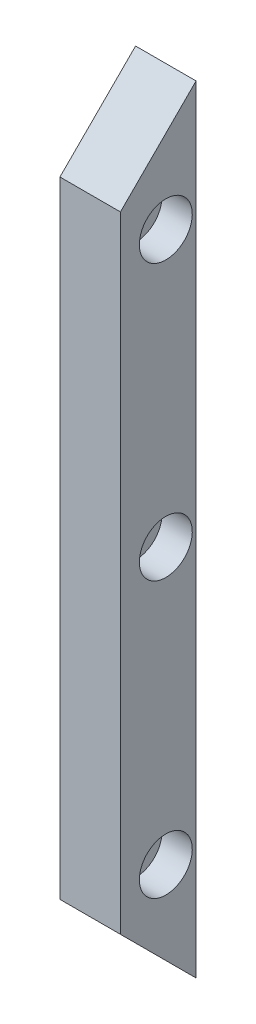
ISO-10303-21;
HEADER;
FILE_DESCRIPTION(('STEP AP214'),'2;1');
FILE_NAME('part.step','',(''),(''),'','','');
FILE_SCHEMA(('AUTOMOTIVE_DESIGN { 1 0 10303 214 1 1 1 1 }'));
ENDSEC;
DATA;
#1=APPLICATION_CONTEXT('core data for automotive mechanical design processes');
#2=APPLICATION_PROTOCOL_DEFINITION('international standard','automotive_design',2000,#1);
#3=PRODUCT_CONTEXT('',#1,'mechanical');
#4=PRODUCT('Part','Part','',(#3));
#5=PRODUCT_RELATED_PRODUCT_CATEGORY('part','',(#4));
#6=PRODUCT_DEFINITION_FORMATION('','',#4);
#7=PRODUCT_DEFINITION_CONTEXT('part definition',#1,'design');
#8=PRODUCT_DEFINITION('design','',#6,#7);
#9=PRODUCT_DEFINITION_SHAPE('','',#8);
#10=(LENGTH_UNIT() NAMED_UNIT(*) SI_UNIT(.MILLI.,.METRE.));
#11=(NAMED_UNIT(*) PLANE_ANGLE_UNIT() SI_UNIT($,.RADIAN.));
#12=(NAMED_UNIT(*) SI_UNIT($,.STERADIAN.) SOLID_ANGLE_UNIT());
#13=UNCERTAINTY_MEASURE_WITH_UNIT(LENGTH_MEASURE(1.E-05),#10,'distance_accuracy_value','');
#14=(GEOMETRIC_REPRESENTATION_CONTEXT(3) GLOBAL_UNCERTAINTY_ASSIGNED_CONTEXT((#13)) GLOBAL_UNIT_ASSIGNED_CONTEXT((#10,
#11,#12)) REPRESENTATION_CONTEXT('',''));
#15=CARTESIAN_POINT('',(0.,0.,0.));
#16=DIRECTION('',(0.,0.,1.));
#17=DIRECTION('',(1.,0.,0.));
#18=AXIS2_PLACEMENT_3D('',#15,#16,#17);
#19=CARTESIAN_POINT('',(7.99999999999994,-61.9999999999953,8.));
#20=DIRECTION('',(0.,0.,-1.));
#21=DIRECTION('',(1.,0.,0.));
#22=AXIS2_PLACEMENT_3D('',#19,#20,#21);
#23=PLANE('',#22);
#24=DIRECTION('',(0.,1.,0.));
#25=VECTOR('',#24,1.);
#26=CARTESIAN_POINT('',(0.,-61.9999999999952,8.));
#27=LINE('',#26,#25);
#28=CARTESIAN_POINT('',(0.,-61.9999999999952,8.));
#29=VERTEX_POINT('',#28);
#30=CARTESIAN_POINT('',(0.,40.7303555077418,8.));
#31=VERTEX_POINT('',#30);
#32=EDGE_CURVE('E101',#29,#31,#27,.T.);
#33=ORIENTED_EDGE('',*,*,#32,.T.);
#34=DIRECTION('',(-1.,0.,0.));
#35=VECTOR('',#34,1.);
#36=CARTESIAN_POINT('',(8.00000000000004,40.7303555077418,8.));
#37=LINE('',#36,#35);
#38=CARTESIAN_POINT('',(8.00000000000004,40.7303555077418,8.));
#39=VERTEX_POINT('',#38);
#40=EDGE_CURVE('E94',#39,#31,#37,.T.);
#41=ORIENTED_EDGE('',*,*,#40,.F.);
#42=DIRECTION('',(0.,1.,0.));
#43=VECTOR('',#42,1.);
#44=CARTESIAN_POINT('',(7.99999999999994,-61.9999999999953,8.));
#45=LINE('',#44,#43);
#46=CARTESIAN_POINT('',(7.99999999999994,-61.9999999999953,8.));
#47=VERTEX_POINT('',#46);
#48=EDGE_CURVE('E88',#47,#39,#45,.T.);
#49=ORIENTED_EDGE('',*,*,#48,.F.);
#50=DIRECTION('',(-1.,0.,0.));
#51=VECTOR('',#50,1.);
#52=CARTESIAN_POINT('',(7.99999999999994,-61.9999999999953,8.));
#53=LINE('',#52,#51);
#54=EDGE_CURVE('E11',#47,#29,#53,.T.);
#55=ORIENTED_EDGE('',*,*,#54,.T.);
#56=EDGE_LOOP('',(#33,#41,#49,#55));
#57=FACE_BOUND('',#56,.T.);
#58=ADVANCED_FACE('F35',(#57),#23,.T.);
#59=CARTESIAN_POINT('',(7.99999999999995,-51.9999999999952,18.));
#60=DIRECTION('',(0.,-0.707106781186545,0.70710678118655));
#61=DIRECTION('',(0.,-0.70710678118655,-0.707106781186545));
#62=AXIS2_PLACEMENT_3D('',#59,#60,#61);
#63=PLANE('',#62);
#64=DIRECTION('',(0.,-0.70710678118655,-0.707106781186545));
#65=VECTOR('',#64,1.);
#66=CARTESIAN_POINT('',(0.,-51.9999999999952,18.));
#67=LINE('',#66,#65);
#68=CARTESIAN_POINT('',(0.,-51.9999999999952,18.));
#69=VERTEX_POINT('',#68);
#70=EDGE_CURVE('E76',#69,#29,#67,.T.);
#71=ORIENTED_EDGE('',*,*,#70,.T.);
#72=ORIENTED_EDGE('',*,*,#54,.F.);
#73=DIRECTION('',(0.,-0.70710678118655,-0.707106781186545));
#74=VECTOR('',#73,1.);
#75=CARTESIAN_POINT('',(7.99999999999995,-51.9999999999952,18.));
#76=LINE('',#75,#74);
#77=CARTESIAN_POINT('',(7.99999999999995,-51.9999999999952,18.));
#78=VERTEX_POINT('',#77);
#79=EDGE_CURVE('E53',#78,#47,#76,.T.);
#80=ORIENTED_EDGE('',*,*,#79,.F.);
#81=DIRECTION('',(-1.,0.,0.));
#82=VECTOR('',#81,1.);
#83=CARTESIAN_POINT('',(7.99999999999995,-51.9999999999952,18.));
#84=LINE('',#83,#82);
#85=EDGE_CURVE('E44',#78,#69,#84,.T.);
#86=ORIENTED_EDGE('',*,*,#85,.T.);
#87=EDGE_LOOP('',(#71,#72,#80,#86));
#88=FACE_BOUND('',#87,.T.);
#89=ADVANCED_FACE('F167',(#88),#63,.T.);
#90=CARTESIAN_POINT('',(8.00000000000003,30.7303555077419,18.));
#91=DIRECTION('',(0.,0.,1.));
#92=DIRECTION('',(0.,-1.,0.));
#93=AXIS2_PLACEMENT_3D('',#90,#91,#92);
#94=PLANE('',#93);
#95=DIRECTION('',(0.,-1.,0.));
#96=VECTOR('',#95,1.);
#97=CARTESIAN_POINT('',(0.,30.7303555077419,18.));
#98=LINE('',#97,#96);
#99=CARTESIAN_POINT('',(0.,30.7303555077419,18.));
#100=VERTEX_POINT('',#99);
#101=EDGE_CURVE('E70',#100,#69,#98,.T.);
#102=ORIENTED_EDGE('',*,*,#101,.T.);
#103=ORIENTED_EDGE('',*,*,#85,.F.);
#104=DIRECTION('',(0.,-1.,0.));
#105=VECTOR('',#104,1.);
#106=CARTESIAN_POINT('',(8.00000000000003,30.7303555077419,18.));
#107=LINE('',#106,#105);
#108=CARTESIAN_POINT('',(8.00000000000003,30.7303555077419,18.));
#109=VERTEX_POINT('',#108);
#110=EDGE_CURVE('E86',#109,#78,#107,.T.);
#111=ORIENTED_EDGE('',*,*,#110,.F.);
#112=DIRECTION('',(-1.,0.,0.));
#113=VECTOR('',#112,1.);
#114=CARTESIAN_POINT('',(8.00000000000003,30.7303555077419,18.));
#115=LINE('',#114,#113);
#116=EDGE_CURVE('E91',#109,#100,#115,.T.);
#117=ORIENTED_EDGE('',*,*,#116,.T.);
#118=EDGE_LOOP('',(#102,#103,#111,#117));
#119=FACE_BOUND('',#118,.T.);
#120=ADVANCED_FACE('F96',(#119),#94,.T.);
#121=CARTESIAN_POINT('',(8.00000000000004,40.7303555077418,8.));
#122=DIRECTION('',(0.,0.707106781186554,0.707106781186541));
#123=DIRECTION('',(0.,-0.707106781186541,0.707106781186554));
#124=AXIS2_PLACEMENT_3D('',#121,#122,#123);
#125=PLANE('',#124);
#126=DIRECTION('',(0.,-0.707106781186541,0.707106781186554));
#127=VECTOR('',#126,1.);
#128=CARTESIAN_POINT('',(0.,40.7303555077418,8.));
#129=LINE('',#128,#127);
#130=EDGE_CURVE('E93',#31,#100,#129,.T.);
#131=ORIENTED_EDGE('',*,*,#130,.T.);
#132=ORIENTED_EDGE('',*,*,#116,.F.);
#133=DIRECTION('',(0.,-0.707106781186541,0.707106781186554));
#134=VECTOR('',#133,1.);
#135=CARTESIAN_POINT('',(8.00000000000004,40.7303555077418,8.));
#136=LINE('',#135,#134);
#137=EDGE_CURVE('E83',#39,#109,#136,.T.);
#138=ORIENTED_EDGE('',*,*,#137,.F.);
#139=ORIENTED_EDGE('',*,*,#40,.T.);
#140=EDGE_LOOP('',(#131,#132,#138,#139));
#141=FACE_BOUND('',#140,.T.);
#142=ADVANCED_FACE('F92',(#141),#125,.T.);
#143=CARTESIAN_POINT('',(8.,0.,0.));
#144=DIRECTION('',(-1.,0.,0.));
#145=DIRECTION('',(0.,1.,0.));
#146=AXIS2_PLACEMENT_3D('',#143,#144,#145);
#147=PLANE('',#146);
#148=CARTESIAN_POINT('',(8.00000000000002,25.7303555077418,12.));
#149=DIRECTION('',(1.,0.,0.));
#150=DIRECTION('',(0.,1.,0.));
#151=AXIS2_PLACEMENT_3D('',#148,#149,#150);
#152=CIRCLE('',#151,3.5);
#153=CARTESIAN_POINT('',(8.00000000000003,29.2303555077418,12.));
#154=VERTEX_POINT('',#153);
#155=EDGE_CURVE('E38',#154,#154,#152,.T.);
#156=ORIENTED_EDGE('',*,*,#155,.F.);
#157=EDGE_LOOP('',(#156));
#158=FACE_BOUND('',#157,.T.);
#159=CARTESIAN_POINT('',(7.99999999999999,-10.6348222461267,12.));
#160=DIRECTION('',(1.,0.,0.));
#161=DIRECTION('',(0.,1.,0.));
#162=AXIS2_PLACEMENT_3D('',#159,#160,#161);
#163=CIRCLE('',#162,3.5);
#164=CARTESIAN_POINT('',(7.99999999999999,-7.13482224612673,12.));
#165=VERTEX_POINT('',#164);
#166=EDGE_CURVE('E122',#165,#165,#163,.T.);
#167=ORIENTED_EDGE('',*,*,#166,.F.);
#168=EDGE_LOOP('',(#167));
#169=FACE_BOUND('',#168,.T.);
#170=CARTESIAN_POINT('',(7.99999999999995,-46.9999999999952,12.));
#171=DIRECTION('',(1.,0.,0.));
#172=DIRECTION('',(0.,1.,0.));
#173=AXIS2_PLACEMENT_3D('',#170,#171,#172);
#174=CIRCLE('',#173,3.5);
#175=CARTESIAN_POINT('',(7.99999999999996,-43.4999999999952,12.));
#176=VERTEX_POINT('',#175);
#177=EDGE_CURVE('E120',#176,#176,#174,.T.);
#178=ORIENTED_EDGE('',*,*,#177,.F.);
#179=EDGE_LOOP('',(#178));
#180=FACE_BOUND('',#179,.T.);
#181=ORIENTED_EDGE('',*,*,#48,.T.);
#182=ORIENTED_EDGE('',*,*,#137,.T.);
#183=ORIENTED_EDGE('',*,*,#110,.T.);
#184=ORIENTED_EDGE('',*,*,#79,.T.);
#185=EDGE_LOOP('',(#181,#182,#183,#184));
#186=FACE_BOUND('',#185,.T.);
#187=ADVANCED_FACE('F84',(#158,#169,#180,#186),#147,.F.);
#188=CARTESIAN_POINT('',(0.,0.,0.));
#189=DIRECTION('',(-1.,0.,0.));
#190=DIRECTION('',(0.,1.,0.));
#191=AXIS2_PLACEMENT_3D('',#188,#189,#190);
#192=PLANE('',#191);
#193=CARTESIAN_POINT('',(0.,25.7303555077418,12.));
#194=DIRECTION('',(1.,0.,0.));
#195=DIRECTION('',(0.,1.,0.));
#196=AXIS2_PLACEMENT_3D('',#193,#194,#195);
#197=CIRCLE('',#196,1.6);
#198=CARTESIAN_POINT('',(0.,27.3303555077418,12.));
#199=VERTEX_POINT('',#198);
#200=EDGE_CURVE('E104',#199,#199,#197,.T.);
#201=ORIENTED_EDGE('',*,*,#200,.T.);
#202=EDGE_LOOP('',(#201));
#203=FACE_BOUND('',#202,.T.);
#204=CARTESIAN_POINT('',(0.,-10.6348222461267,12.));
#205=DIRECTION('',(1.,0.,0.));
#206=DIRECTION('',(0.,1.,0.));
#207=AXIS2_PLACEMENT_3D('',#204,#205,#206);
#208=CIRCLE('',#207,1.6);
#209=CARTESIAN_POINT('',(0.,-9.03482224612672,12.));
#210=VERTEX_POINT('',#209);
#211=EDGE_CURVE('E131',#210,#210,#208,.T.);
#212=ORIENTED_EDGE('',*,*,#211,.T.);
#213=EDGE_LOOP('',(#212));
#214=FACE_BOUND('',#213,.T.);
#215=CARTESIAN_POINT('',(0.,-46.9999999999951,12.));
#216=DIRECTION('',(1.,0.,0.));
#217=DIRECTION('',(0.,1.,0.));
#218=AXIS2_PLACEMENT_3D('',#215,#216,#217);
#219=CIRCLE('',#218,1.6);
#220=CARTESIAN_POINT('',(0.,-45.3999999999952,12.));
#221=VERTEX_POINT('',#220);
#222=EDGE_CURVE('E127',#221,#221,#219,.T.);
#223=ORIENTED_EDGE('',*,*,#222,.T.);
#224=EDGE_LOOP('',(#223));
#225=FACE_BOUND('',#224,.T.);
#226=ORIENTED_EDGE('',*,*,#32,.F.);
#227=ORIENTED_EDGE('',*,*,#70,.F.);
#228=ORIENTED_EDGE('',*,*,#101,.F.);
#229=ORIENTED_EDGE('',*,*,#130,.F.);
#230=EDGE_LOOP('',(#226,#227,#228,#229));
#231=FACE_BOUND('',#230,.T.);
#232=ADVANCED_FACE('F175',(#203,#214,#225,#231),#192,.T.);
#233=CARTESIAN_POINT('',(9.99999999999995,-46.9999999999952,12.));
#234=DIRECTION('',(-1.,0.,0.));
#235=DIRECTION('',(0.,1.,0.));
#236=AXIS2_PLACEMENT_3D('',#233,#234,#235);
#237=CYLINDRICAL_SURFACE('',#236,1.6);
#238=CARTESIAN_POINT('',(3.99999999999531,-46.9999999999952,12.));
#239=DIRECTION('',(1.,0.,0.));
#240=DIRECTION('',(0.,1.,0.));
#241=AXIS2_PLACEMENT_3D('',#238,#239,#240);
#242=CIRCLE('',#241,1.6);
#243=CARTESIAN_POINT('',(3.99999999999531,-45.3999999999952,12.));
#244=VERTEX_POINT('',#243);
#245=EDGE_CURVE('E117',#244,#244,#242,.F.);
#246=ORIENTED_EDGE('',*,*,#245,.F.);
#247=EDGE_LOOP('',(#246));
#248=FACE_BOUND('',#247,.T.);
#249=ORIENTED_EDGE('',*,*,#222,.F.);
#250=EDGE_LOOP('',(#249));
#251=FACE_BOUND('',#250,.T.);
#252=ADVANCED_FACE('F177',(#248,#251),#237,.F.);
#253=CARTESIAN_POINT('',(9.99999999999999,-10.6348222461267,12.));
#254=DIRECTION('',(-1.,0.,0.));
#255=DIRECTION('',(0.,1.,0.));
#256=AXIS2_PLACEMENT_3D('',#253,#254,#255);
#257=CYLINDRICAL_SURFACE('',#256,1.6);
#258=CARTESIAN_POINT('',(3.99999999999535,-10.6348222461267,12.));
#259=DIRECTION('',(1.,0.,0.));
#260=DIRECTION('',(0.,1.,0.));
#261=AXIS2_PLACEMENT_3D('',#258,#259,#260);
#262=CIRCLE('',#261,1.6);
#263=CARTESIAN_POINT('',(3.99999999999535,-9.03482224612673,12.));
#264=VERTEX_POINT('',#263);
#265=EDGE_CURVE('E113',#264,#264,#262,.F.);
#266=ORIENTED_EDGE('',*,*,#265,.F.);
#267=EDGE_LOOP('',(#266));
#268=FACE_BOUND('',#267,.T.);
#269=ORIENTED_EDGE('',*,*,#211,.F.);
#270=EDGE_LOOP('',(#269));
#271=FACE_BOUND('',#270,.T.);
#272=ADVANCED_FACE('F162',(#268,#271),#257,.F.);
#273=CARTESIAN_POINT('',(10.,25.7303555077418,12.));
#274=DIRECTION('',(-1.,0.,0.));
#275=DIRECTION('',(0.,1.,0.));
#276=AXIS2_PLACEMENT_3D('',#273,#274,#275);
#277=CYLINDRICAL_SURFACE('',#276,1.6);
#278=CARTESIAN_POINT('',(3.99999999999539,25.7303555077418,12.));
#279=DIRECTION('',(1.,0.,0.));
#280=DIRECTION('',(0.,1.,0.));
#281=AXIS2_PLACEMENT_3D('',#278,#279,#280);
#282=CIRCLE('',#281,1.6);
#283=CARTESIAN_POINT('',(3.99999999999539,27.3303555077418,12.));
#284=VERTEX_POINT('',#283);
#285=EDGE_CURVE('E110',#284,#284,#282,.F.);
#286=ORIENTED_EDGE('',*,*,#285,.F.);
#287=EDGE_LOOP('',(#286));
#288=FACE_BOUND('',#287,.T.);
#289=ORIENTED_EDGE('',*,*,#200,.F.);
#290=EDGE_LOOP('',(#289));
#291=FACE_BOUND('',#290,.T.);
#292=ADVANCED_FACE('F154',(#288,#291),#277,.F.);
#293=CARTESIAN_POINT('',(13.9999999999954,25.7303555077418,12.));
#294=DIRECTION('',(-1.,0.,0.));
#295=DIRECTION('',(0.,1.,0.));
#296=AXIS2_PLACEMENT_3D('',#293,#294,#295);
#297=CYLINDRICAL_SURFACE('',#296,3.5);
#298=CARTESIAN_POINT('',(3.99999999999539,25.7303555077418,12.));
#299=DIRECTION('',(1.,0.,0.));
#300=DIRECTION('',(0.,1.,0.));
#301=AXIS2_PLACEMENT_3D('',#298,#299,#300);
#302=CIRCLE('',#301,3.5);
#303=CARTESIAN_POINT('',(3.99999999999539,29.2303555077418,12.));
#304=VERTEX_POINT('',#303);
#305=EDGE_CURVE('E114',#304,#304,#302,.T.);
#306=ORIENTED_EDGE('',*,*,#305,.F.);
#307=EDGE_LOOP('',(#306));
#308=FACE_BOUND('',#307,.T.);
#309=ORIENTED_EDGE('',*,*,#155,.T.);
#310=EDGE_LOOP('',(#309));
#311=FACE_BOUND('',#310,.T.);
#312=ADVANCED_FACE('F152',(#308,#311),#297,.F.);
#313=CARTESIAN_POINT('',(3.99999999999539,25.7303555077418,12.));
#314=DIRECTION('',(-1.,0.,0.));
#315=DIRECTION('',(0.,1.,0.));
#316=AXIS2_PLACEMENT_3D('',#313,#314,#315);
#317=PLANE('',#316);
#318=ORIENTED_EDGE('',*,*,#305,.T.);
#319=EDGE_LOOP('',(#318));
#320=FACE_BOUND('',#319,.T.);
#321=ORIENTED_EDGE('',*,*,#285,.T.);
#322=EDGE_LOOP('',(#321));
#323=FACE_BOUND('',#322,.T.);
#324=ADVANCED_FACE('F149',(#320,#323),#317,.F.);
#325=CARTESIAN_POINT('',(13.9999999999953,-10.6348222461267,12.));
#326=DIRECTION('',(-1.,0.,0.));
#327=DIRECTION('',(0.,1.,0.));
#328=AXIS2_PLACEMENT_3D('',#325,#326,#327);
#329=CYLINDRICAL_SURFACE('',#328,3.5);
#330=CARTESIAN_POINT('',(3.99999999999535,-10.6348222461267,12.));
#331=DIRECTION('',(1.,0.,0.));
#332=DIRECTION('',(0.,1.,0.));
#333=AXIS2_PLACEMENT_3D('',#330,#331,#332);
#334=CIRCLE('',#333,3.5);
#335=CARTESIAN_POINT('',(3.99999999999535,-7.13482224612673,12.));
#336=VERTEX_POINT('',#335);
#337=EDGE_CURVE('E143',#336,#336,#334,.T.);
#338=ORIENTED_EDGE('',*,*,#337,.F.);
#339=EDGE_LOOP('',(#338));
#340=FACE_BOUND('',#339,.T.);
#341=ORIENTED_EDGE('',*,*,#166,.T.);
#342=EDGE_LOOP('',(#341));
#343=FACE_BOUND('',#342,.T.);
#344=ADVANCED_FACE('F160',(#340,#343),#329,.F.);
#345=CARTESIAN_POINT('',(3.99999999999535,-10.6348222461267,12.));
#346=DIRECTION('',(-1.,0.,0.));
#347=DIRECTION('',(0.,1.,0.));
#348=AXIS2_PLACEMENT_3D('',#345,#346,#347);
#349=PLANE('',#348);
#350=ORIENTED_EDGE('',*,*,#337,.T.);
#351=EDGE_LOOP('',(#350));
#352=FACE_BOUND('',#351,.T.);
#353=ORIENTED_EDGE('',*,*,#265,.T.);
#354=EDGE_LOOP('',(#353));
#355=FACE_BOUND('',#354,.T.);
#356=ADVANCED_FACE('F244',(#352,#355),#349,.F.);
#357=CARTESIAN_POINT('',(13.9999999999953,-46.9999999999952,12.));
#358=DIRECTION('',(-1.,0.,0.));
#359=DIRECTION('',(0.,1.,0.));
#360=AXIS2_PLACEMENT_3D('',#357,#358,#359);
#361=CYLINDRICAL_SURFACE('',#360,3.5);
#362=CARTESIAN_POINT('',(3.99999999999531,-46.9999999999952,12.));
#363=DIRECTION('',(1.,0.,0.));
#364=DIRECTION('',(0.,1.,0.));
#365=AXIS2_PLACEMENT_3D('',#362,#363,#364);
#366=CIRCLE('',#365,3.5);
#367=CARTESIAN_POINT('',(3.99999999999531,-43.4999999999952,12.));
#368=VERTEX_POINT('',#367);
#369=EDGE_CURVE('E140',#368,#368,#366,.T.);
#370=ORIENTED_EDGE('',*,*,#369,.F.);
#371=EDGE_LOOP('',(#370));
#372=FACE_BOUND('',#371,.T.);
#373=ORIENTED_EDGE('',*,*,#177,.T.);
#374=EDGE_LOOP('',(#373));
#375=FACE_BOUND('',#374,.T.);
#376=ADVANCED_FACE('F254',(#372,#375),#361,.F.);
#377=CARTESIAN_POINT('',(3.99999999999531,-46.9999999999952,12.));
#378=DIRECTION('',(-1.,0.,0.));
#379=DIRECTION('',(0.,1.,0.));
#380=AXIS2_PLACEMENT_3D('',#377,#378,#379);
#381=PLANE('',#380);
#382=ORIENTED_EDGE('',*,*,#369,.T.);
#383=EDGE_LOOP('',(#382));
#384=FACE_BOUND('',#383,.T.);
#385=ORIENTED_EDGE('',*,*,#245,.T.);
#386=EDGE_LOOP('',(#385));
#387=FACE_BOUND('',#386,.T.);
#388=ADVANCED_FACE('F263',(#384,#387),#381,.F.);
#389=CLOSED_SHELL('',(#58,#89,#120,#142,#187,#232,#252,#272,#292,#312,#324,#344,#356,#376,#388));
#390=MANIFOLD_SOLID_BREP('B2',#389);
#391=ADVANCED_BREP_SHAPE_REPRESENTATION('',(#18,#390),#14);
#392=SHAPE_DEFINITION_REPRESENTATION(#9,#391);
ENDSEC;
END-ISO-10303-21;
